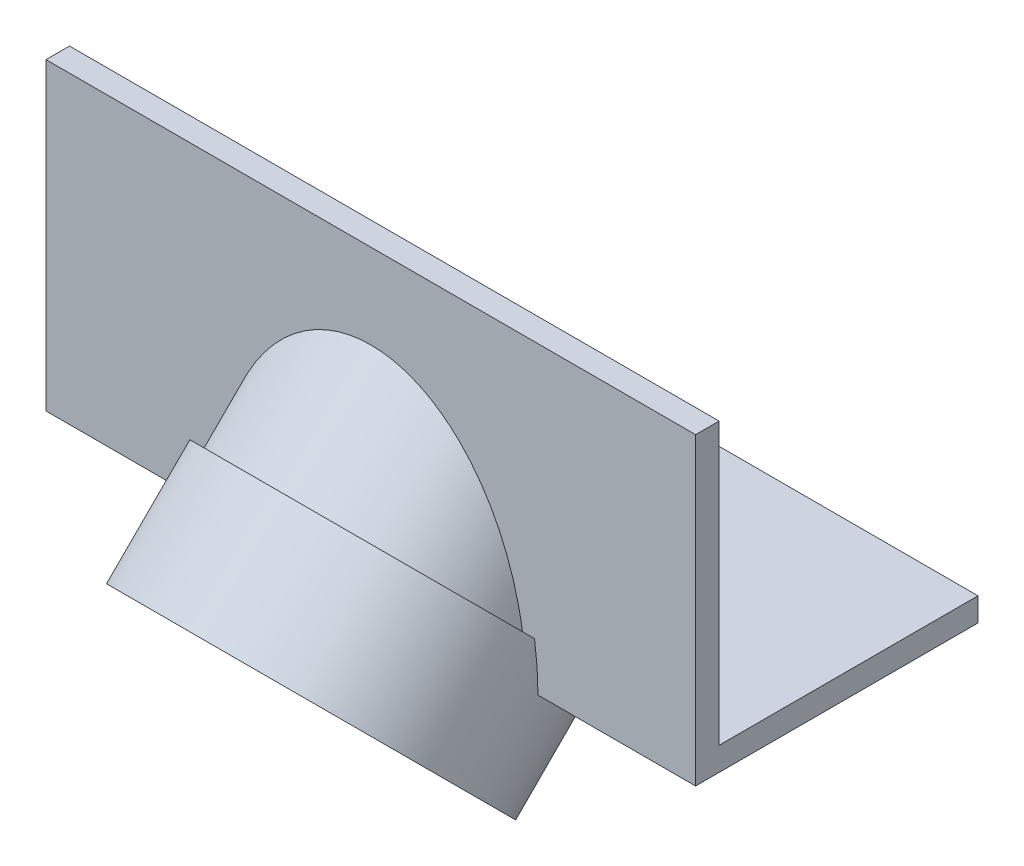
ISO-10303-21;
HEADER;
FILE_DESCRIPTION(('STEP AP214'),'2;1');
FILE_NAME('part.step','',(''),(''),'','','');
FILE_SCHEMA(('AUTOMOTIVE_DESIGN { 1 0 10303 214 1 1 1 1 }'));
ENDSEC;
DATA;
#1=APPLICATION_CONTEXT('core data for automotive mechanical design processes');
#2=APPLICATION_PROTOCOL_DEFINITION('international standard','automotive_design',2000,#1);
#3=PRODUCT_CONTEXT('',#1,'mechanical');
#4=PRODUCT('Part','Part','',(#3));
#5=PRODUCT_RELATED_PRODUCT_CATEGORY('part','',(#4));
#6=PRODUCT_DEFINITION_FORMATION('','',#4);
#7=PRODUCT_DEFINITION_CONTEXT('part definition',#1,'design');
#8=PRODUCT_DEFINITION('design','',#6,#7);
#9=PRODUCT_DEFINITION_SHAPE('','',#8);
#10=(LENGTH_UNIT() NAMED_UNIT(*) SI_UNIT(.MILLI.,.METRE.));
#11=(NAMED_UNIT(*) PLANE_ANGLE_UNIT() SI_UNIT($,.RADIAN.));
#12=(NAMED_UNIT(*) SI_UNIT($,.STERADIAN.) SOLID_ANGLE_UNIT());
#13=UNCERTAINTY_MEASURE_WITH_UNIT(LENGTH_MEASURE(1.E-05),#10,'distance_accuracy_value','');
#14=(GEOMETRIC_REPRESENTATION_CONTEXT(3) GLOBAL_UNCERTAINTY_ASSIGNED_CONTEXT((#13)) GLOBAL_UNIT_ASSIGNED_CONTEXT((#10,
#11,#12)) REPRESENTATION_CONTEXT('',''));
#15=CARTESIAN_POINT('',(0.,0.,0.));
#16=DIRECTION('',(0.,0.,1.));
#17=DIRECTION('',(1.,0.,0.));
#18=AXIS2_PLACEMENT_3D('',#15,#16,#17);
#19=CARTESIAN_POINT('',(13.80109,-4.29411764705883,10.0588235294118));
#20=DIRECTION('',(0.,0.707106781186546,-0.707106781186549));
#21=DIRECTION('',(0.,0.707106781186549,0.707106781186546));
#22=AXIS2_PLACEMENT_3D('',#19,#20,#21);
#23=PLANE('',#22);
#24=CARTESIAN_POINT('',(13.80109,-4.29411764705883,10.0588235294118));
#25=DIRECTION('',(0.,0.707106781186546,-0.707106781186549));
#26=DIRECTION('',(0.,0.707106781186549,0.707106781186546));
#27=AXIS2_PLACEMENT_3D('',#24,#25,#26);
#28=CIRCLE('',#27,5.1);
#29=CARTESIAN_POINT('',(13.80109,-0.687873063007434,13.6650681134632));
#30=VERTEX_POINT('',#29);
#31=EDGE_CURVE('E135',#30,#30,#28,.T.);
#32=ORIENTED_EDGE('',*,*,#31,.F.);
#33=EDGE_LOOP('',(#32));
#34=FACE_BOUND('',#33,.T.);
#35=CARTESIAN_POINT('',(13.80109,-4.29411764705883,10.0588235294118));
#36=DIRECTION('',(0.,0.707106781186546,-0.707106781186549));
#37=DIRECTION('',(0.,0.707106781186549,0.707106781186546));
#38=AXIS2_PLACEMENT_3D('',#35,#36,#37);
#39=CIRCLE('',#38,5.6);
#40=CARTESIAN_POINT('',(13.80109,-0.33431967241416,14.0186215040564));
#41=VERTEX_POINT('',#40);
#42=EDGE_CURVE('E43',#41,#41,#39,.F.);
#43=ORIENTED_EDGE('',*,*,#42,.F.);
#44=EDGE_LOOP('',(#43));
#45=FACE_BOUND('',#44,.T.);
#46=ADVANCED_FACE('F35',(#34,#45),#23,.T.);
#47=CARTESIAN_POINT('',(27.60218,7.63588235294117,10.0588235294118));
#48=DIRECTION('',(0.,-1.,0.));
#49=DIRECTION('',(0.,0.,-1.));
#50=AXIS2_PLACEMENT_3D('',#47,#48,#49);
#51=PLANE('',#50);
#52=DIRECTION('',(0.,0.,1.));
#53=VECTOR('',#52,1.);
#54=CARTESIAN_POINT('',(0.,7.63588235294117,10.0588235294118));
#55=LINE('',#54,#53);
#56=CARTESIAN_POINT('',(0.,7.63588235294117,10.0588235294118));
#57=VERTEX_POINT('',#56);
#58=CARTESIAN_POINT('',(0.,7.63588235294117,11.0588235294118));
#59=VERTEX_POINT('',#58);
#60=EDGE_CURVE('E170',#57,#59,#55,.T.);
#61=ORIENTED_EDGE('',*,*,#60,.T.);
#62=DIRECTION('',(-1.,0.,0.));
#63=VECTOR('',#62,1.);
#64=CARTESIAN_POINT('',(27.60218,7.63588235294117,11.0588235294118));
#65=LINE('',#64,#63);
#66=CARTESIAN_POINT('',(27.60218,7.63588235294117,11.0588235294118));
#67=VERTEX_POINT('',#66);
#68=EDGE_CURVE('E199',#67,#59,#65,.T.);
#69=ORIENTED_EDGE('',*,*,#68,.F.);
#70=DIRECTION('',(0.,0.,1.));
#71=VECTOR('',#70,1.);
#72=CARTESIAN_POINT('',(27.60218,7.63588235294117,10.0588235294118));
#73=LINE('',#72,#71);
#74=CARTESIAN_POINT('',(27.60218,7.63588235294117,10.0588235294118));
#75=VERTEX_POINT('',#74);
#76=EDGE_CURVE('E155',#75,#67,#73,.T.);
#77=ORIENTED_EDGE('',*,*,#76,.F.);
#78=DIRECTION('',(-1.,0.,0.));
#79=VECTOR('',#78,1.);
#80=CARTESIAN_POINT('',(27.60218,7.63588235294117,10.0588235294118));
#81=LINE('',#80,#79);
#82=EDGE_CURVE('E169',#75,#57,#81,.T.);
#83=ORIENTED_EDGE('',*,*,#82,.T.);
#84=EDGE_LOOP('',(#61,#69,#77,#83));
#85=FACE_BOUND('',#84,.T.);
#86=ADVANCED_FACE('F37',(#85),#51,.F.);
#87=CARTESIAN_POINT('',(27.60218,7.63588235294117,11.0588235294118));
#88=DIRECTION('',(0.,0.,-1.));
#89=DIRECTION('',(-1.,0.,0.));
#90=AXIS2_PLACEMENT_3D('',#87,#88,#89);
#91=PLANE('',#90);
#92=CARTESIAN_POINT('',(13.80109,-5.29411764705883,11.0588235294118));
#93=DIRECTION('',(0.,0.,-1.));
#94=DIRECTION('',(0.,-1.,0.));
#95=AXIS2_PLACEMENT_3D('',#92,#93,#94);
#96=ELLIPSE('',#95,9.33380951166241,6.6);
#97=CARTESIAN_POINT('',(20.2477945845145,-3.29411764705883,11.0588235294118));
#98=VERTEX_POINT('',#97);
#99=CARTESIAN_POINT('',(7.35438541548552,-3.29411764705883,11.0588235294118));
#100=VERTEX_POINT('',#99);
#101=EDGE_CURVE('E57',#98,#100,#96,.F.);
#102=ORIENTED_EDGE('',*,*,#101,.F.);
#103=DIRECTION('',(1.,0.,0.));
#104=VECTOR('',#103,1.);
#105=CARTESIAN_POINT('',(27.60218,-3.29411764705883,11.0588235294118));
#106=LINE('',#105,#104);
#107=CARTESIAN_POINT('',(20.7588195147196,-3.29411764705883,11.0588235294118));
#108=VERTEX_POINT('',#107);
#109=EDGE_CURVE('E132',#98,#108,#106,.T.);
#110=ORIENTED_EDGE('',*,*,#109,.T.);
#111=CARTESIAN_POINT('',(13.80109,-5.29411764705883,11.0588235294118));
#112=DIRECTION('',(0.,0.,-1.));
#113=DIRECTION('',(0.,1.,0.));
#114=AXIS2_PLACEMENT_3D('',#111,#112,#113);
#115=ELLIPSE('',#114,10.040916292849,7.1);
#116=CARTESIAN_POINT('',(20.90109,-5.29411764705883,11.0588235294118));
#117=VERTEX_POINT('',#116);
#118=EDGE_CURVE('E151',#108,#117,#115,.T.);
#119=ORIENTED_EDGE('',*,*,#118,.T.);
#120=DIRECTION('',(-1.,0.,0.));
#121=VECTOR('',#120,1.);
#122=CARTESIAN_POINT('',(27.60218,-5.29411764705883,11.0588235294118));
#123=LINE('',#122,#121);
#124=CARTESIAN_POINT('',(27.60218,-5.29411764705883,11.0588235294118));
#125=VERTEX_POINT('',#124);
#126=EDGE_CURVE('E196',#125,#117,#123,.T.);
#127=ORIENTED_EDGE('',*,*,#126,.F.);
#128=DIRECTION('',(0.,-1.,0.));
#129=VECTOR('',#128,1.);
#130=CARTESIAN_POINT('',(27.60218,7.63588235294117,11.0588235294118));
#131=LINE('',#130,#129);
#132=EDGE_CURVE('E158',#67,#125,#131,.T.);
#133=ORIENTED_EDGE('',*,*,#132,.F.);
#134=ORIENTED_EDGE('',*,*,#68,.T.);
#135=DIRECTION('',(0.,-1.,0.));
#136=VECTOR('',#135,1.);
#137=CARTESIAN_POINT('',(0.,7.63588235294117,11.0588235294118));
#138=LINE('',#137,#136);
#139=CARTESIAN_POINT('',(0.,-5.29411764705883,11.0588235294118));
#140=VERTEX_POINT('',#139);
#141=EDGE_CURVE('E173',#59,#140,#138,.T.);
#142=ORIENTED_EDGE('',*,*,#141,.T.);
#143=CARTESIAN_POINT('',(6.70109,-5.29411764705883,11.0588235294118));
#144=VERTEX_POINT('',#143);
#145=EDGE_CURVE('E195',#144,#140,#123,.T.);
#146=ORIENTED_EDGE('',*,*,#145,.F.);
#147=CARTESIAN_POINT('',(6.84336048528042,-3.29411764705883,11.0588235294118));
#148=VERTEX_POINT('',#147);
#149=EDGE_CURVE('E154',#144,#148,#115,.T.);
#150=ORIENTED_EDGE('',*,*,#149,.T.);
#151=EDGE_CURVE('E134',#148,#100,#106,.T.);
#152=ORIENTED_EDGE('',*,*,#151,.T.);
#153=EDGE_LOOP('',(#102,#110,#119,#127,#133,#134,#142,#146,#150,#152));
#154=FACE_BOUND('',#153,.T.);
#155=ADVANCED_FACE('F131',(#154),#91,.F.);
#156=CARTESIAN_POINT('',(27.60218,-5.29411764705883,11.0588235294118));
#157=DIRECTION('',(0.,1.,0.));
#158=DIRECTION('',(0.,0.,1.));
#159=AXIS2_PLACEMENT_3D('',#156,#157,#158);
#160=PLANE('',#159);
#161=CARTESIAN_POINT('',(13.80109,-5.29411764705883,11.0588235294118));
#162=DIRECTION('',(0.,1.,0.));
#163=DIRECTION('',(0.,0.,1.));
#164=AXIS2_PLACEMENT_3D('',#161,#162,#163);
#165=ELLIPSE('',#164,9.33380951166244,6.6);
#166=CARTESIAN_POINT('',(7.35438541548552,-5.29411764705883,9.05882352941178));
#167=VERTEX_POINT('',#166);
#168=CARTESIAN_POINT('',(20.2477945845145,-5.29411764705883,9.05882352941178));
#169=VERTEX_POINT('',#168);
#170=EDGE_CURVE('E136',#167,#169,#165,.F.);
#171=ORIENTED_EDGE('',*,*,#170,.F.);
#172=DIRECTION('',(-1.,0.,0.));
#173=VECTOR('',#172,1.);
#174=CARTESIAN_POINT('',(27.60218,-5.29411764705883,9.05882352941178));
#175=LINE('',#174,#173);
#176=CARTESIAN_POINT('',(6.84336048528042,-5.29411764705883,9.05882352941178));
#177=VERTEX_POINT('',#176);
#178=EDGE_CURVE('E146',#167,#177,#175,.T.);
#179=ORIENTED_EDGE('',*,*,#178,.T.);
#180=CARTESIAN_POINT('',(13.80109,-5.29411764705883,11.0588235294118));
#181=DIRECTION('',(0.,1.,0.));
#182=DIRECTION('',(0.,0.,-1.));
#183=AXIS2_PLACEMENT_3D('',#180,#181,#182);
#184=ELLIPSE('',#183,10.040916292849,7.1);
#185=EDGE_CURVE('E152',#177,#144,#184,.T.);
#186=ORIENTED_EDGE('',*,*,#185,.T.);
#187=ORIENTED_EDGE('',*,*,#145,.T.);
#188=DIRECTION('',(0.,0.,-1.));
#189=VECTOR('',#188,1.);
#190=CARTESIAN_POINT('',(0.,-5.29411764705883,11.0588235294118));
#191=LINE('',#190,#189);
#192=CARTESIAN_POINT('',(0.,-5.29411764705883,-0.941176470588223));
#193=VERTEX_POINT('',#192);
#194=EDGE_CURVE('E176',#140,#193,#191,.T.);
#195=ORIENTED_EDGE('',*,*,#194,.T.);
#196=DIRECTION('',(-1.,0.,0.));
#197=VECTOR('',#196,1.);
#198=CARTESIAN_POINT('',(27.60218,-5.29411764705883,-0.941176470588223));
#199=LINE('',#198,#197);
#200=CARTESIAN_POINT('',(27.60218,-5.29411764705883,-0.941176470588223));
#201=VERTEX_POINT('',#200);
#202=EDGE_CURVE('E192',#201,#193,#199,.T.);
#203=ORIENTED_EDGE('',*,*,#202,.F.);
#204=DIRECTION('',(0.,0.,-1.));
#205=VECTOR('',#204,1.);
#206=CARTESIAN_POINT('',(27.60218,-5.29411764705883,11.0588235294118));
#207=LINE('',#206,#205);
#208=EDGE_CURVE('E161',#125,#201,#207,.T.);
#209=ORIENTED_EDGE('',*,*,#208,.F.);
#210=ORIENTED_EDGE('',*,*,#126,.T.);
#211=CARTESIAN_POINT('',(20.7588195147196,-5.29411764705883,9.05882352941178));
#212=VERTEX_POINT('',#211);
#213=EDGE_CURVE('E144',#117,#212,#184,.T.);
#214=ORIENTED_EDGE('',*,*,#213,.T.);
#215=EDGE_CURVE('E142',#212,#169,#175,.T.);
#216=ORIENTED_EDGE('',*,*,#215,.T.);
#217=EDGE_LOOP('',(#171,#179,#186,#187,#195,#203,#209,#210,#214,#216));
#218=FACE_BOUND('',#217,.T.);
#219=ADVANCED_FACE('F250',(#218),#160,.F.);
#220=CARTESIAN_POINT('',(27.60218,-5.29411764705883,-0.941176470588223));
#221=DIRECTION('',(0.,0.,1.));
#222=DIRECTION('',(1.,0.,0.));
#223=AXIS2_PLACEMENT_3D('',#220,#221,#222);
#224=PLANE('',#223);
#225=DIRECTION('',(0.,1.,0.));
#226=VECTOR('',#225,1.);
#227=CARTESIAN_POINT('',(0.,-5.29411764705883,-0.941176470588223));
#228=LINE('',#227,#226);
#229=CARTESIAN_POINT('',(0.,-4.29411764705883,-0.941176470588223));
#230=VERTEX_POINT('',#229);
#231=EDGE_CURVE('E178',#193,#230,#228,.T.);
#232=ORIENTED_EDGE('',*,*,#231,.T.);
#233=DIRECTION('',(-1.,0.,0.));
#234=VECTOR('',#233,1.);
#235=CARTESIAN_POINT('',(27.60218,-4.29411764705883,-0.941176470588223));
#236=LINE('',#235,#234);
#237=CARTESIAN_POINT('',(27.60218,-4.29411764705883,-0.941176470588223));
#238=VERTEX_POINT('',#237);
#239=EDGE_CURVE('E189',#238,#230,#236,.T.);
#240=ORIENTED_EDGE('',*,*,#239,.F.);
#241=DIRECTION('',(0.,1.,0.));
#242=VECTOR('',#241,1.);
#243=CARTESIAN_POINT('',(27.60218,-5.29411764705883,-0.941176470588223));
#244=LINE('',#243,#242);
#245=EDGE_CURVE('E163',#201,#238,#244,.T.);
#246=ORIENTED_EDGE('',*,*,#245,.F.);
#247=ORIENTED_EDGE('',*,*,#202,.T.);
#248=EDGE_LOOP('',(#232,#240,#246,#247));
#249=FACE_BOUND('',#248,.T.);
#250=ADVANCED_FACE('F246',(#249),#224,.F.);
#251=CARTESIAN_POINT('',(27.60218,-4.29411764705883,-0.941176470588223));
#252=DIRECTION('',(0.,-1.,0.));
#253=DIRECTION('',(0.,0.,-1.));
#254=AXIS2_PLACEMENT_3D('',#251,#252,#253);
#255=PLANE('',#254);
#256=CARTESIAN_POINT('',(13.80109,-4.29411764705883,10.0588235294118));
#257=DIRECTION('',(0.,-1.,0.));
#258=DIRECTION('',(0.,0.,1.));
#259=AXIS2_PLACEMENT_3D('',#256,#257,#258);
#260=ELLIPSE('',#259,9.33380951166244,6.6);
#261=CARTESIAN_POINT('',(20.40109,-4.29411764705883,10.0588235294118));
#262=VERTEX_POINT('',#261);
#263=CARTESIAN_POINT('',(7.20109,-4.29411764705883,10.0588235294118));
#264=VERTEX_POINT('',#263);
#265=EDGE_CURVE('E363',#262,#264,#260,.F.);
#266=ORIENTED_EDGE('',*,*,#265,.F.);
#267=DIRECTION('',(-1.,0.,0.));
#268=VECTOR('',#267,1.);
#269=CARTESIAN_POINT('',(27.60218,-4.29411764705883,10.0588235294118));
#270=LINE('',#269,#268);
#271=CARTESIAN_POINT('',(27.60218,-4.29411764705883,10.0588235294118));
#272=VERTEX_POINT('',#271);
#273=EDGE_CURVE('E187',#272,#262,#270,.T.);
#274=ORIENTED_EDGE('',*,*,#273,.F.);
#275=DIRECTION('',(0.,0.,1.));
#276=VECTOR('',#275,1.);
#277=CARTESIAN_POINT('',(27.60218,-4.29411764705883,-0.941176470588223));
#278=LINE('',#277,#276);
#279=EDGE_CURVE('E165',#238,#272,#278,.T.);
#280=ORIENTED_EDGE('',*,*,#279,.F.);
#281=ORIENTED_EDGE('',*,*,#239,.T.);
#282=DIRECTION('',(0.,0.,1.));
#283=VECTOR('',#282,1.);
#284=CARTESIAN_POINT('',(0.,-4.29411764705883,-0.941176470588223));
#285=LINE('',#284,#283);
#286=CARTESIAN_POINT('',(0.,-4.29411764705883,10.0588235294118));
#287=VERTEX_POINT('',#286);
#288=EDGE_CURVE('E180',#230,#287,#285,.T.);
#289=ORIENTED_EDGE('',*,*,#288,.T.);
#290=EDGE_CURVE('E186',#264,#287,#270,.T.);
#291=ORIENTED_EDGE('',*,*,#290,.F.);
#292=EDGE_LOOP('',(#266,#274,#280,#281,#289,#291));
#293=FACE_BOUND('',#292,.T.);
#294=ADVANCED_FACE('F243',(#293),#255,.F.);
#295=CARTESIAN_POINT('',(27.60218,-4.29411764705883,10.0588235294118));
#296=DIRECTION('',(0.,0.,1.));
#297=DIRECTION('',(1.,0.,0.));
#298=AXIS2_PLACEMENT_3D('',#295,#296,#297);
#299=PLANE('',#298);
#300=CARTESIAN_POINT('',(13.80109,-4.29411764705883,10.0588235294118));
#301=DIRECTION('',(0.,0.,1.));
#302=DIRECTION('',(0.,-1.,0.));
#303=AXIS2_PLACEMENT_3D('',#300,#301,#302);
#304=ELLIPSE('',#303,9.33380951166241,6.6);
#305=EDGE_CURVE('E50',#264,#262,#304,.F.);
#306=ORIENTED_EDGE('',*,*,#305,.F.);
#307=ORIENTED_EDGE('',*,*,#290,.T.);
#308=DIRECTION('',(0.,1.,0.));
#309=VECTOR('',#308,1.);
#310=CARTESIAN_POINT('',(0.,-4.29411764705883,10.0588235294118));
#311=LINE('',#310,#309);
#312=EDGE_CURVE('E159',#287,#57,#311,.T.);
#313=ORIENTED_EDGE('',*,*,#312,.T.);
#314=ORIENTED_EDGE('',*,*,#82,.F.);
#315=DIRECTION('',(0.,1.,0.));
#316=VECTOR('',#315,1.);
#317=CARTESIAN_POINT('',(27.60218,-4.29411764705883,10.0588235294118));
#318=LINE('',#317,#316);
#319=EDGE_CURVE('E167',#272,#75,#318,.T.);
#320=ORIENTED_EDGE('',*,*,#319,.F.);
#321=ORIENTED_EDGE('',*,*,#273,.T.);
#322=EDGE_LOOP('',(#306,#307,#313,#314,#320,#321));
#323=FACE_BOUND('',#322,.T.);
#324=ADVANCED_FACE('F238',(#323),#299,.F.);
#325=CARTESIAN_POINT('',(27.60218,0.,0.));
#326=DIRECTION('',(1.,0.,0.));
#327=DIRECTION('',(0.,0.,-1.));
#328=AXIS2_PLACEMENT_3D('',#325,#326,#327);
#329=PLANE('',#328);
#330=ORIENTED_EDGE('',*,*,#76,.T.);
#331=ORIENTED_EDGE('',*,*,#132,.T.);
#332=ORIENTED_EDGE('',*,*,#208,.T.);
#333=ORIENTED_EDGE('',*,*,#245,.T.);
#334=ORIENTED_EDGE('',*,*,#279,.T.);
#335=ORIENTED_EDGE('',*,*,#319,.T.);
#336=EDGE_LOOP('',(#330,#331,#332,#333,#334,#335));
#337=FACE_BOUND('',#336,.T.);
#338=ADVANCED_FACE('F231',(#337),#329,.T.);
#339=CARTESIAN_POINT('',(0.,0.,0.));
#340=DIRECTION('',(1.,0.,0.));
#341=DIRECTION('',(0.,0.,-1.));
#342=AXIS2_PLACEMENT_3D('',#339,#340,#341);
#343=PLANE('',#342);
#344=ORIENTED_EDGE('',*,*,#60,.F.);
#345=ORIENTED_EDGE('',*,*,#312,.F.);
#346=ORIENTED_EDGE('',*,*,#288,.F.);
#347=ORIENTED_EDGE('',*,*,#231,.F.);
#348=ORIENTED_EDGE('',*,*,#194,.F.);
#349=ORIENTED_EDGE('',*,*,#141,.F.);
#350=EDGE_LOOP('',(#344,#345,#346,#347,#348,#349));
#351=FACE_BOUND('',#350,.T.);
#352=ADVANCED_FACE('F227',(#351),#343,.F.);
#353=CARTESIAN_POINT('',(13.80109,-7.82965155299157,13.5943574353445));
#354=DIRECTION('',(0.,0.707106781186546,-0.707106781186549));
#355=DIRECTION('',(0.,0.707106781186549,0.707106781186546));
#356=AXIS2_PLACEMENT_3D('',#353,#354,#355);
#357=CYLINDRICAL_SURFACE('',#356,7.1);
#358=CARTESIAN_POINT('',(13.80109,-7.82965155299157,13.5943574353445));
#359=DIRECTION('',(0.,0.707106781186546,-0.707106781186549));
#360=DIRECTION('',(0.,0.707106781186549,0.707106781186546));
#361=AXIS2_PLACEMENT_3D('',#358,#359,#360);
#362=CIRCLE('',#361,7.1);
#363=CARTESIAN_POINT('',(13.80109,-2.80919340656707,18.614815581769));
#364=VERTEX_POINT('',#363);
#365=EDGE_CURVE('E354',#364,#364,#362,.T.);
#366=ORIENTED_EDGE('',*,*,#365,.T.);
#367=EDGE_LOOP('',(#366));
#368=FACE_BOUND('',#367,.T.);
#369=ORIENTED_EDGE('',*,*,#149,.F.);
#370=ORIENTED_EDGE('',*,*,#185,.F.);
#371=CARTESIAN_POINT('',(13.80109,-4.29411764705883,10.0588235294118));
#372=DIRECTION('',(0.,0.707106781186546,-0.707106781186549));
#373=DIRECTION('',(0.,0.707106781186549,0.707106781186546));
#374=AXIS2_PLACEMENT_3D('',#371,#372,#373);
#375=CIRCLE('',#374,7.1);
#376=EDGE_CURVE('E355',#212,#177,#375,.T.);
#377=ORIENTED_EDGE('',*,*,#376,.F.);
#378=ORIENTED_EDGE('',*,*,#213,.F.);
#379=ORIENTED_EDGE('',*,*,#118,.F.);
#380=EDGE_CURVE('E141',#148,#108,#375,.T.);
#381=ORIENTED_EDGE('',*,*,#380,.F.);
#382=EDGE_LOOP('',(#369,#370,#377,#378,#379,#381));
#383=FACE_BOUND('',#382,.T.);
#384=ADVANCED_FACE('F224',(#368,#383),#357,.T.);
#385=ORIENTED_EDGE('',*,*,#109,.F.);
#386=CARTESIAN_POINT('',(13.80109,-4.29411764705883,10.0588235294118));
#387=DIRECTION('',(0.,0.707106781186546,-0.707106781186549));
#388=DIRECTION('',(0.,0.707106781186549,0.707106781186546));
#389=AXIS2_PLACEMENT_3D('',#386,#387,#388);
#390=CIRCLE('',#389,6.6);
#391=EDGE_CURVE('E121',#100,#98,#390,.T.);
#392=ORIENTED_EDGE('',*,*,#391,.F.);
#393=ORIENTED_EDGE('',*,*,#151,.F.);
#394=ORIENTED_EDGE('',*,*,#380,.T.);
#395=EDGE_LOOP('',(#385,#392,#393,#394));
#396=FACE_BOUND('',#395,.T.);
#397=ADVANCED_FACE('F139',(#396),#23,.T.);
#398=ORIENTED_EDGE('',*,*,#178,.F.);
#399=CARTESIAN_POINT('',(13.80109,-4.29411764705883,10.0588235294118));
#400=DIRECTION('',(0.,0.707106781186546,-0.707106781186549));
#401=DIRECTION('',(0.,0.707106781186549,0.707106781186546));
#402=AXIS2_PLACEMENT_3D('',#399,#400,#401);
#403=CIRCLE('',#402,6.6);
#404=EDGE_CURVE('E11',#167,#169,#403,.F.);
#405=ORIENTED_EDGE('',*,*,#404,.T.);
#406=ORIENTED_EDGE('',*,*,#215,.F.);
#407=ORIENTED_EDGE('',*,*,#376,.T.);
#408=EDGE_LOOP('',(#398,#405,#406,#407));
#409=FACE_BOUND('',#408,.T.);
#410=ADVANCED_FACE('F210',(#409),#23,.T.);
#411=CARTESIAN_POINT('',(13.80109,-7.82965155299157,13.5943574353445));
#412=DIRECTION('',(0.,0.707106781186546,-0.707106781186549));
#413=DIRECTION('',(0.,0.707106781186549,0.707106781186546));
#414=AXIS2_PLACEMENT_3D('',#411,#412,#413);
#415=CYLINDRICAL_SURFACE('',#414,5.1);
#416=ORIENTED_EDGE('',*,*,#31,.T.);
#417=EDGE_LOOP('',(#416));
#418=FACE_BOUND('',#417,.T.);
#419=CARTESIAN_POINT('',(13.80109,-7.82965155299157,13.5943574353445));
#420=DIRECTION('',(0.,0.707106781186546,-0.707106781186549));
#421=DIRECTION('',(0.,0.707106781186549,0.707106781186546));
#422=AXIS2_PLACEMENT_3D('',#419,#420,#421);
#423=CIRCLE('',#422,5.1);
#424=CARTESIAN_POINT('',(13.80109,-4.22340696894017,17.2006020193959));
#425=VERTEX_POINT('',#424);
#426=EDGE_CURVE('E352',#425,#425,#423,.T.);
#427=ORIENTED_EDGE('',*,*,#426,.F.);
#428=EDGE_LOOP('',(#427));
#429=FACE_BOUND('',#428,.T.);
#430=ADVANCED_FACE('F221',(#418,#429),#415,.F.);
#431=CARTESIAN_POINT('',(13.80109,-7.82965155299157,13.5943574353445));
#432=DIRECTION('',(0.,0.707106781186546,-0.707106781186549));
#433=DIRECTION('',(0.,0.707106781186549,0.707106781186546));
#434=AXIS2_PLACEMENT_3D('',#431,#432,#433);
#435=PLANE('',#434);
#436=ORIENTED_EDGE('',*,*,#426,.T.);
#437=EDGE_LOOP('',(#436));
#438=FACE_BOUND('',#437,.T.);
#439=ORIENTED_EDGE('',*,*,#365,.F.);
#440=EDGE_LOOP('',(#439));
#441=FACE_BOUND('',#440,.T.);
#442=ADVANCED_FACE('F261',(#438,#441),#435,.F.);
#443=CARTESIAN_POINT('',(13.80109,1.09403602558265,4.67066985677028));
#444=DIRECTION('',(0.,-0.707106781186546,0.707106781186549));
#445=DIRECTION('',(0.,-0.707106781186549,-0.707106781186546));
#446=AXIS2_PLACEMENT_3D('',#443,#444,#445);
#447=CYLINDRICAL_SURFACE('',#446,6.6);
#448=ORIENTED_EDGE('',*,*,#404,.F.);
#449=ORIENTED_EDGE('',*,*,#170,.T.);
#450=EDGE_LOOP('',(#448,#449));
#451=FACE_BOUND('',#450,.T.);
#452=ADVANCED_FACE('F290',(#451),#447,.T.);
#453=CARTESIAN_POINT('',(13.80109,1.09403602558265,4.67066985677028));
#454=DIRECTION('',(0.,-0.707106781186546,0.707106781186549));
#455=DIRECTION('',(0.,-0.707106781186549,-0.707106781186546));
#456=AXIS2_PLACEMENT_3D('',#453,#454,#455);
#457=CYLINDRICAL_SURFACE('',#456,5.6);
#458=ORIENTED_EDGE('',*,*,#42,.T.);
#459=EDGE_LOOP('',(#458));
#460=FACE_BOUND('',#459,.T.);
#461=CARTESIAN_POINT('',(13.80109,1.09403602558265,4.67066985677028));
#462=DIRECTION('',(0.,0.707106781186546,-0.707106781186549));
#463=DIRECTION('',(0.,0.707106781186549,0.707106781186546));
#464=AXIS2_PLACEMENT_3D('',#461,#462,#463);
#465=CIRCLE('',#464,5.6);
#466=CARTESIAN_POINT('',(13.80109,5.05383400022732,8.63046783141494));
#467=VERTEX_POINT('',#466);
#468=EDGE_CURVE('E128',#467,#467,#465,.T.);
#469=ORIENTED_EDGE('',*,*,#468,.T.);
#470=EDGE_LOOP('',(#469));
#471=FACE_BOUND('',#470,.T.);
#472=ADVANCED_FACE('F204',(#460,#471),#457,.F.);
#473=ORIENTED_EDGE('',*,*,#391,.T.);
#474=ORIENTED_EDGE('',*,*,#101,.T.);
#475=EDGE_LOOP('',(#473,#474));
#476=FACE_BOUND('',#475,.T.);
#477=ADVANCED_FACE('F122',(#476),#447,.T.);
#478=CARTESIAN_POINT('',(13.80109,1.09403602558265,4.67066985677028));
#479=DIRECTION('',(0.,0.707106781186546,-0.707106781186549));
#480=DIRECTION('',(0.,0.707106781186549,0.707106781186546));
#481=AXIS2_PLACEMENT_3D('',#478,#479,#480);
#482=CIRCLE('',#481,6.6);
#483=CARTESIAN_POINT('',(13.80109,5.76094078141387,9.33757461260148));
#484=VERTEX_POINT('',#483);
#485=EDGE_CURVE('E127',#484,#484,#482,.T.);
#486=ORIENTED_EDGE('',*,*,#485,.F.);
#487=EDGE_LOOP('',(#486));
#488=FACE_BOUND('',#487,.T.);
#489=ORIENTED_EDGE('',*,*,#305,.T.);
#490=ORIENTED_EDGE('',*,*,#265,.T.);
#491=EDGE_LOOP('',(#489,#490));
#492=FACE_BOUND('',#491,.T.);
#493=ADVANCED_FACE('F297',(#488,#492),#447,.T.);
#494=CARTESIAN_POINT('',(13.80109,1.09403602558265,4.67066985677028));
#495=DIRECTION('',(0.,0.707106781186546,-0.707106781186549));
#496=DIRECTION('',(0.,0.707106781186549,0.707106781186546));
#497=AXIS2_PLACEMENT_3D('',#494,#495,#496);
#498=PLANE('',#497);
#499=ORIENTED_EDGE('',*,*,#485,.T.);
#500=EDGE_LOOP('',(#499));
#501=FACE_BOUND('',#500,.T.);
#502=ORIENTED_EDGE('',*,*,#468,.F.);
#503=EDGE_LOOP('',(#502));
#504=FACE_BOUND('',#503,.T.);
#505=ADVANCED_FACE('F315',(#501,#504),#498,.T.);
#506=CLOSED_SHELL('',(#46,#86,#155,#219,#250,#294,#324,#338,#352,#384,#397,#410,#430,#442,#452,
#472,#477,#493,#505));
#507=MANIFOLD_SOLID_BREP('B2',#506);
#508=ADVANCED_BREP_SHAPE_REPRESENTATION('',(#18,#507),#14);
#509=SHAPE_DEFINITION_REPRESENTATION(#9,#508);
ENDSEC;
END-ISO-10303-21;
